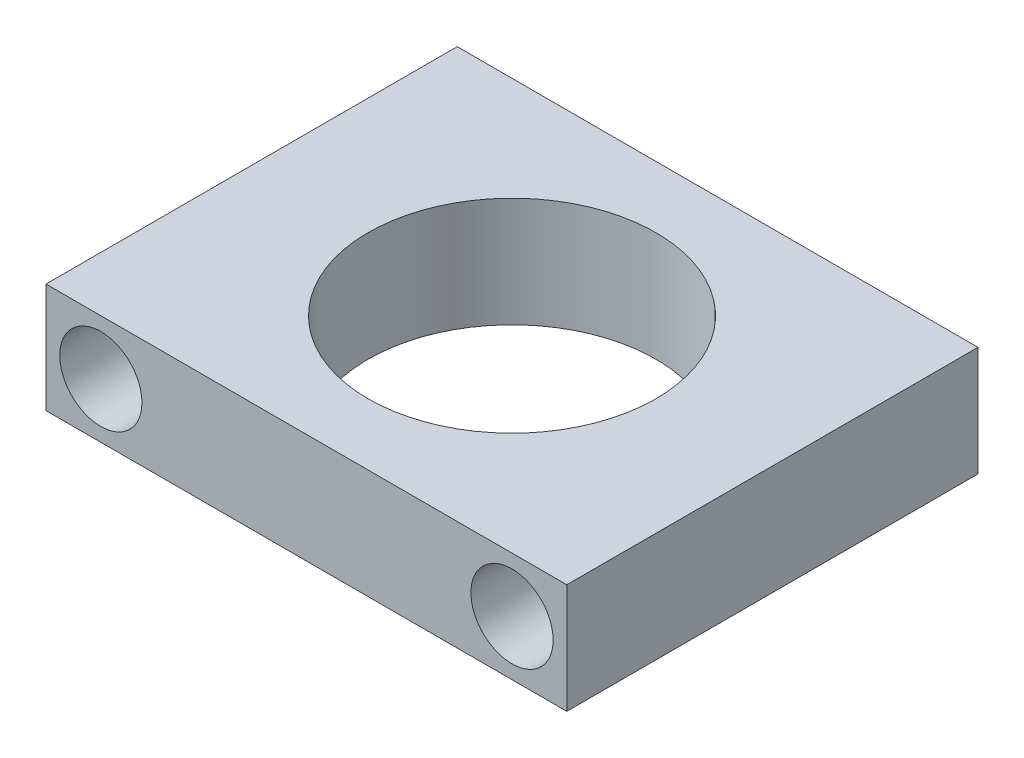
ISO-10303-21;
HEADER;
FILE_DESCRIPTION(('STEP AP214'),'2;1');
FILE_NAME('part.step','',(''),(''),'','','');
FILE_SCHEMA(('AUTOMOTIVE_DESIGN { 1 0 10303 214 1 1 1 1 }'));
ENDSEC;
DATA;
#1=APPLICATION_CONTEXT('core data for automotive mechanical design processes');
#2=APPLICATION_PROTOCOL_DEFINITION('international standard','automotive_design',2000,#1);
#3=PRODUCT_CONTEXT('',#1,'mechanical');
#4=PRODUCT('Part','Part','',(#3));
#5=PRODUCT_RELATED_PRODUCT_CATEGORY('part','',(#4));
#6=PRODUCT_DEFINITION_FORMATION('','',#4);
#7=PRODUCT_DEFINITION_CONTEXT('part definition',#1,'design');
#8=PRODUCT_DEFINITION('design','',#6,#7);
#9=PRODUCT_DEFINITION_SHAPE('','',#8);
#10=(LENGTH_UNIT() NAMED_UNIT(*) SI_UNIT(.MILLI.,.METRE.));
#11=(NAMED_UNIT(*) PLANE_ANGLE_UNIT() SI_UNIT($,.RADIAN.));
#12=(NAMED_UNIT(*) SI_UNIT($,.STERADIAN.) SOLID_ANGLE_UNIT());
#13=UNCERTAINTY_MEASURE_WITH_UNIT(LENGTH_MEASURE(1.E-05),#10,'distance_accuracy_value','');
#14=(GEOMETRIC_REPRESENTATION_CONTEXT(3) GLOBAL_UNCERTAINTY_ASSIGNED_CONTEXT((#13)) GLOBAL_UNIT_ASSIGNED_CONTEXT((#10,
#11,#12)) REPRESENTATION_CONTEXT('',''));
#15=CARTESIAN_POINT('',(0.,0.,0.));
#16=DIRECTION('',(0.,0.,1.));
#17=DIRECTION('',(1.,0.,0.));
#18=AXIS2_PLACEMENT_3D('',#15,#16,#17);
#19=CARTESIAN_POINT('',(0.,4.,0.));
#20=DIRECTION('',(0.,-1.,0.));
#21=DIRECTION('',(0.,0.,-1.));
#22=AXIS2_PLACEMENT_3D('',#19,#20,#21);
#23=PLANE('',#22);
#24=DIRECTION('',(0.,0.,1.));
#25=VECTOR('',#24,1.);
#26=CARTESIAN_POINT('',(0.,4.,0.));
#27=LINE('',#26,#25);
#28=CARTESIAN_POINT('',(0.,4.,-15.));
#29=VERTEX_POINT('',#28);
#30=CARTESIAN_POINT('',(0.,4.,0.));
#31=VERTEX_POINT('',#30);
#32=EDGE_CURVE('E92',#29,#31,#27,.T.);
#33=ORIENTED_EDGE('',*,*,#32,.T.);
#34=DIRECTION('',(1.,0.,0.));
#35=VECTOR('',#34,1.);
#36=CARTESIAN_POINT('',(0.,4.,0.));
#37=LINE('',#36,#35);
#38=CARTESIAN_POINT('',(19.,4.,0.));
#39=VERTEX_POINT('',#38);
#40=EDGE_CURVE('E87',#31,#39,#37,.T.);
#41=ORIENTED_EDGE('',*,*,#40,.T.);
#42=DIRECTION('',(0.,0.,-1.));
#43=VECTOR('',#42,1.);
#44=CARTESIAN_POINT('',(19.,4.,0.));
#45=LINE('',#44,#43);
#46=CARTESIAN_POINT('',(19.,4.,-15.));
#47=VERTEX_POINT('',#46);
#48=EDGE_CURVE('E90',#39,#47,#45,.T.);
#49=ORIENTED_EDGE('',*,*,#48,.T.);
#50=DIRECTION('',(-1.,0.,0.));
#51=VECTOR('',#50,1.);
#52=CARTESIAN_POINT('',(0.,4.,-15.));
#53=LINE('',#52,#51);
#54=EDGE_CURVE('E57',#47,#29,#53,.T.);
#55=ORIENTED_EDGE('',*,*,#54,.T.);
#56=EDGE_LOOP('',(#33,#41,#49,#55));
#57=FACE_BOUND('',#56,.T.);
#58=CARTESIAN_POINT('',(9.5,4.,-7.5));
#59=DIRECTION('',(0.,1.,0.));
#60=DIRECTION('',(0.,0.,1.));
#61=AXIS2_PLACEMENT_3D('',#58,#59,#60);
#62=CIRCLE('',#61,5.25);
#63=CARTESIAN_POINT('',(9.5,4.,-2.25));
#64=VERTEX_POINT('',#63);
#65=EDGE_CURVE('E112',#64,#64,#62,.T.);
#66=ORIENTED_EDGE('',*,*,#65,.F.);
#67=EDGE_LOOP('',(#66));
#68=FACE_BOUND('',#67,.T.);
#69=ADVANCED_FACE('F39',(#57,#68),#23,.F.);
#70=CARTESIAN_POINT('',(0.,0.,0.));
#71=DIRECTION('',(0.,-1.,0.));
#72=DIRECTION('',(0.,0.,-1.));
#73=AXIS2_PLACEMENT_3D('',#70,#71,#72);
#74=PLANE('',#73);
#75=DIRECTION('',(0.,0.,1.));
#76=VECTOR('',#75,1.);
#77=CARTESIAN_POINT('',(0.,0.,0.));
#78=LINE('',#77,#76);
#79=CARTESIAN_POINT('',(0.,0.,-15.));
#80=VERTEX_POINT('',#79);
#81=CARTESIAN_POINT('',(0.,0.,0.));
#82=VERTEX_POINT('',#81);
#83=EDGE_CURVE('E108',#80,#82,#78,.T.);
#84=ORIENTED_EDGE('',*,*,#83,.F.);
#85=DIRECTION('',(-1.,0.,0.));
#86=VECTOR('',#85,1.);
#87=CARTESIAN_POINT('',(0.,0.,-15.));
#88=LINE('',#87,#86);
#89=CARTESIAN_POINT('',(19.,0.,-15.));
#90=VERTEX_POINT('',#89);
#91=EDGE_CURVE('E80',#90,#80,#88,.T.);
#92=ORIENTED_EDGE('',*,*,#91,.F.);
#93=DIRECTION('',(0.,0.,-1.));
#94=VECTOR('',#93,1.);
#95=CARTESIAN_POINT('',(19.,0.,0.));
#96=LINE('',#95,#94);
#97=CARTESIAN_POINT('',(19.,0.,0.));
#98=VERTEX_POINT('',#97);
#99=EDGE_CURVE('E74',#98,#90,#96,.T.);
#100=ORIENTED_EDGE('',*,*,#99,.F.);
#101=DIRECTION('',(1.,0.,0.));
#102=VECTOR('',#101,1.);
#103=CARTESIAN_POINT('',(0.,0.,0.));
#104=LINE('',#103,#102);
#105=EDGE_CURVE('E97',#82,#98,#104,.T.);
#106=ORIENTED_EDGE('',*,*,#105,.F.);
#107=EDGE_LOOP('',(#84,#92,#100,#106));
#108=FACE_BOUND('',#107,.T.);
#109=CARTESIAN_POINT('',(9.5,0.,-7.5));
#110=DIRECTION('',(0.,1.,0.));
#111=DIRECTION('',(0.,0.,1.));
#112=AXIS2_PLACEMENT_3D('',#109,#110,#111);
#113=CIRCLE('',#112,5.25);
#114=CARTESIAN_POINT('',(9.5,0.,-2.25));
#115=VERTEX_POINT('',#114);
#116=EDGE_CURVE('E130',#115,#115,#113,.T.);
#117=ORIENTED_EDGE('',*,*,#116,.T.);
#118=EDGE_LOOP('',(#117));
#119=FACE_BOUND('',#118,.T.);
#120=ADVANCED_FACE('F125',(#108,#119),#74,.T.);
#121=CARTESIAN_POINT('',(0.,4.,0.));
#122=DIRECTION('',(1.,0.,0.));
#123=DIRECTION('',(0.,0.,-1.));
#124=AXIS2_PLACEMENT_3D('',#121,#122,#123);
#125=PLANE('',#124);
#126=ORIENTED_EDGE('',*,*,#83,.T.);
#127=DIRECTION('',(0.,-1.,0.));
#128=VECTOR('',#127,1.);
#129=CARTESIAN_POINT('',(0.,4.,0.));
#130=LINE('',#129,#128);
#131=EDGE_CURVE('E11',#31,#82,#130,.T.);
#132=ORIENTED_EDGE('',*,*,#131,.F.);
#133=ORIENTED_EDGE('',*,*,#32,.F.);
#134=DIRECTION('',(0.,-1.,0.));
#135=VECTOR('',#134,1.);
#136=CARTESIAN_POINT('',(0.,4.,-15.));
#137=LINE('',#136,#135);
#138=EDGE_CURVE('E104',#29,#80,#137,.T.);
#139=ORIENTED_EDGE('',*,*,#138,.T.);
#140=EDGE_LOOP('',(#126,#132,#133,#139));
#141=FACE_BOUND('',#140,.T.);
#142=ADVANCED_FACE('F41',(#141),#125,.F.);
#143=CARTESIAN_POINT('',(0.,4.,0.));
#144=DIRECTION('',(0.,0.,-1.));
#145=DIRECTION('',(-1.,0.,0.));
#146=AXIS2_PLACEMENT_3D('',#143,#144,#145);
#147=PLANE('',#146);
#148=CARTESIAN_POINT('',(2.,2.,0.));
#149=DIRECTION('',(0.,0.,1.));
#150=DIRECTION('',(1.,0.,0.));
#151=AXIS2_PLACEMENT_3D('',#148,#149,#150);
#152=CIRCLE('',#151,1.5);
#153=CARTESIAN_POINT('',(3.5,2.,0.));
#154=VERTEX_POINT('',#153);
#155=EDGE_CURVE('E146',#154,#154,#152,.T.);
#156=ORIENTED_EDGE('',*,*,#155,.F.);
#157=EDGE_LOOP('',(#156));
#158=FACE_BOUND('',#157,.T.);
#159=CARTESIAN_POINT('',(17.,2.,0.));
#160=DIRECTION('',(0.,0.,1.));
#161=DIRECTION('',(1.,0.,0.));
#162=AXIS2_PLACEMENT_3D('',#159,#160,#161);
#163=CIRCLE('',#162,1.5);
#164=CARTESIAN_POINT('',(18.5,2.,0.));
#165=VERTEX_POINT('',#164);
#166=EDGE_CURVE('E138',#165,#165,#163,.T.);
#167=ORIENTED_EDGE('',*,*,#166,.F.);
#168=EDGE_LOOP('',(#167));
#169=FACE_BOUND('',#168,.T.);
#170=ORIENTED_EDGE('',*,*,#105,.T.);
#171=DIRECTION('',(0.,-1.,0.));
#172=VECTOR('',#171,1.);
#173=CARTESIAN_POINT('',(19.,4.,0.));
#174=LINE('',#173,#172);
#175=EDGE_CURVE('E49',#39,#98,#174,.T.);
#176=ORIENTED_EDGE('',*,*,#175,.F.);
#177=ORIENTED_EDGE('',*,*,#40,.F.);
#178=ORIENTED_EDGE('',*,*,#131,.T.);
#179=EDGE_LOOP('',(#170,#176,#177,#178));
#180=FACE_BOUND('',#179,.T.);
#181=ADVANCED_FACE('F96',(#158,#169,#180),#147,.F.);
#182=CARTESIAN_POINT('',(19.,4.,0.));
#183=DIRECTION('',(-1.,0.,0.));
#184=DIRECTION('',(0.,0.,1.));
#185=AXIS2_PLACEMENT_3D('',#182,#183,#184);
#186=PLANE('',#185);
#187=ORIENTED_EDGE('',*,*,#99,.T.);
#188=DIRECTION('',(0.,-1.,0.));
#189=VECTOR('',#188,1.);
#190=CARTESIAN_POINT('',(19.,4.,-15.));
#191=LINE('',#190,#189);
#192=EDGE_CURVE('E99',#47,#90,#191,.T.);
#193=ORIENTED_EDGE('',*,*,#192,.F.);
#194=ORIENTED_EDGE('',*,*,#48,.F.);
#195=ORIENTED_EDGE('',*,*,#175,.T.);
#196=EDGE_LOOP('',(#187,#193,#194,#195));
#197=FACE_BOUND('',#196,.T.);
#198=ADVANCED_FACE('F100',(#197),#186,.F.);
#199=CARTESIAN_POINT('',(0.,4.,-15.));
#200=DIRECTION('',(0.,0.,1.));
#201=DIRECTION('',(1.,0.,0.));
#202=AXIS2_PLACEMENT_3D('',#199,#200,#201);
#203=PLANE('',#202);
#204=CARTESIAN_POINT('',(2.,2.,-15.));
#205=DIRECTION('',(0.,0.,1.));
#206=DIRECTION('',(1.,0.,0.));
#207=AXIS2_PLACEMENT_3D('',#204,#205,#206);
#208=CIRCLE('',#207,1.5);
#209=CARTESIAN_POINT('',(3.5,2.,-15.));
#210=VERTEX_POINT('',#209);
#211=EDGE_CURVE('E134',#210,#210,#208,.T.);
#212=ORIENTED_EDGE('',*,*,#211,.T.);
#213=EDGE_LOOP('',(#212));
#214=FACE_BOUND('',#213,.T.);
#215=CARTESIAN_POINT('',(17.,2.,-15.));
#216=DIRECTION('',(0.,0.,1.));
#217=DIRECTION('',(1.,0.,0.));
#218=AXIS2_PLACEMENT_3D('',#215,#216,#217);
#219=CIRCLE('',#218,1.5);
#220=CARTESIAN_POINT('',(18.5,2.,-15.));
#221=VERTEX_POINT('',#220);
#222=EDGE_CURVE('E142',#221,#221,#219,.T.);
#223=ORIENTED_EDGE('',*,*,#222,.T.);
#224=EDGE_LOOP('',(#223));
#225=FACE_BOUND('',#224,.T.);
#226=ORIENTED_EDGE('',*,*,#91,.T.);
#227=ORIENTED_EDGE('',*,*,#138,.F.);
#228=ORIENTED_EDGE('',*,*,#54,.F.);
#229=ORIENTED_EDGE('',*,*,#192,.T.);
#230=EDGE_LOOP('',(#226,#227,#228,#229));
#231=FACE_BOUND('',#230,.T.);
#232=ADVANCED_FACE('F122',(#214,#225,#231),#203,.F.);
#233=CARTESIAN_POINT('',(9.5,4.,-7.5));
#234=DIRECTION('',(0.,-1.,0.));
#235=DIRECTION('',(0.,0.,-1.));
#236=AXIS2_PLACEMENT_3D('',#233,#234,#235);
#237=CYLINDRICAL_SURFACE('',#236,5.25);
#238=ORIENTED_EDGE('',*,*,#65,.T.);
#239=EDGE_LOOP('',(#238));
#240=FACE_BOUND('',#239,.T.);
#241=ORIENTED_EDGE('',*,*,#116,.F.);
#242=EDGE_LOOP('',(#241));
#243=FACE_BOUND('',#242,.T.);
#244=ADVANCED_FACE('F168',(#240,#243),#237,.F.);
#245=CARTESIAN_POINT('',(17.,2.,-15.));
#246=DIRECTION('',(0.,0.,1.));
#247=DIRECTION('',(1.,0.,0.));
#248=AXIS2_PLACEMENT_3D('',#245,#246,#247);
#249=CYLINDRICAL_SURFACE('',#248,1.5);
#250=ORIENTED_EDGE('',*,*,#222,.F.);
#251=EDGE_LOOP('',(#250));
#252=FACE_BOUND('',#251,.T.);
#253=ORIENTED_EDGE('',*,*,#166,.T.);
#254=EDGE_LOOP('',(#253));
#255=FACE_BOUND('',#254,.T.);
#256=ADVANCED_FACE('F159',(#252,#255),#249,.F.);
#257=CARTESIAN_POINT('',(2.,2.,-15.));
#258=DIRECTION('',(0.,0.,1.));
#259=DIRECTION('',(1.,0.,0.));
#260=AXIS2_PLACEMENT_3D('',#257,#258,#259);
#261=CYLINDRICAL_SURFACE('',#260,1.5);
#262=ORIENTED_EDGE('',*,*,#211,.F.);
#263=EDGE_LOOP('',(#262));
#264=FACE_BOUND('',#263,.T.);
#265=ORIENTED_EDGE('',*,*,#155,.T.);
#266=EDGE_LOOP('',(#265));
#267=FACE_BOUND('',#266,.T.);
#268=ADVANCED_FACE('F156',(#264,#267),#261,.F.);
#269=CLOSED_SHELL('',(#69,#120,#142,#181,#198,#232,#244,#256,#268));
#270=MANIFOLD_SOLID_BREP('B2',#269);
#271=ADVANCED_BREP_SHAPE_REPRESENTATION('',(#18,#270),#14);
#272=SHAPE_DEFINITION_REPRESENTATION(#9,#271);
ENDSEC;
END-ISO-10303-21;
